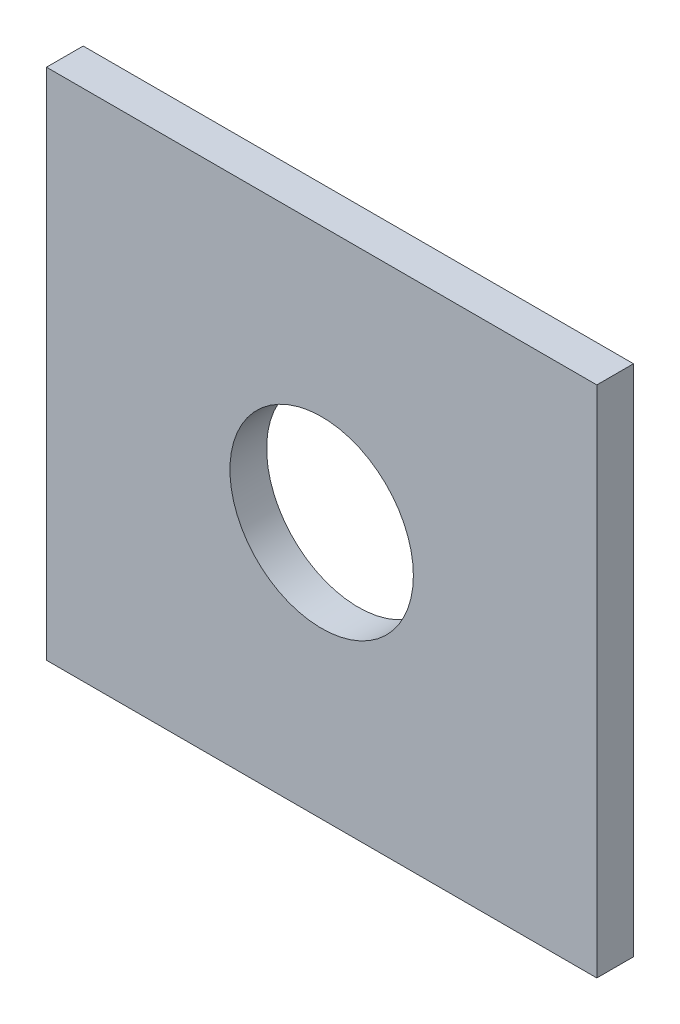
ISO-10303-21;
HEADER;
FILE_DESCRIPTION(('STEP AP214'),'2;1');
FILE_NAME('part.step','',(''),(''),'','','');
FILE_SCHEMA(('AUTOMOTIVE_DESIGN { 1 0 10303 214 1 1 1 1 }'));
ENDSEC;
DATA;
#1=APPLICATION_CONTEXT('core data for automotive mechanical design processes');
#2=APPLICATION_PROTOCOL_DEFINITION('international standard','automotive_design',2000,#1);
#3=PRODUCT_CONTEXT('',#1,'mechanical');
#4=PRODUCT('Part','Part','',(#3));
#5=PRODUCT_RELATED_PRODUCT_CATEGORY('part','',(#4));
#6=PRODUCT_DEFINITION_FORMATION('','',#4);
#7=PRODUCT_DEFINITION_CONTEXT('part definition',#1,'design');
#8=PRODUCT_DEFINITION('design','',#6,#7);
#9=PRODUCT_DEFINITION_SHAPE('','',#8);
#10=(LENGTH_UNIT() NAMED_UNIT(*) SI_UNIT(.MILLI.,.METRE.));
#11=(NAMED_UNIT(*) PLANE_ANGLE_UNIT() SI_UNIT($,.RADIAN.));
#12=(NAMED_UNIT(*) SI_UNIT($,.STERADIAN.) SOLID_ANGLE_UNIT());
#13=UNCERTAINTY_MEASURE_WITH_UNIT(LENGTH_MEASURE(1.E-05),#10,'distance_accuracy_value','');
#14=(GEOMETRIC_REPRESENTATION_CONTEXT(3) GLOBAL_UNCERTAINTY_ASSIGNED_CONTEXT((#13)) GLOBAL_UNIT_ASSIGNED_CONTEXT((#10,
#11,#12)) REPRESENTATION_CONTEXT('',''));
#15=CARTESIAN_POINT('',(0.,0.,0.));
#16=DIRECTION('',(0.,0.,1.));
#17=DIRECTION('',(1.,0.,0.));
#18=AXIS2_PLACEMENT_3D('',#15,#16,#17);
#19=CARTESIAN_POINT('',(0.,0.,10.));
#20=DIRECTION('',(0.,0.,1.));
#21=DIRECTION('',(1.,0.,0.));
#22=AXIS2_PLACEMENT_3D('',#19,#20,#21);
#23=PLANE('',#22);
#24=DIRECTION('',(0.,-1.,0.));
#25=VECTOR('',#24,1.);
#26=CARTESIAN_POINT('',(-75.,-70.,10.));
#27=LINE('',#26,#25);
#28=CARTESIAN_POINT('',(-75.,70.,10.));
#29=VERTEX_POINT('',#28);
#30=CARTESIAN_POINT('',(-75.,-70.,10.));
#31=VERTEX_POINT('',#30);
#32=EDGE_CURVE('E91',#29,#31,#27,.T.);
#33=ORIENTED_EDGE('',*,*,#32,.T.);
#34=DIRECTION('',(1.,0.,0.));
#35=VECTOR('',#34,1.);
#36=CARTESIAN_POINT('',(75.,-70.,10.));
#37=LINE('',#36,#35);
#38=CARTESIAN_POINT('',(75.,-70.,10.));
#39=VERTEX_POINT('',#38);
#40=EDGE_CURVE('E86',#31,#39,#37,.T.);
#41=ORIENTED_EDGE('',*,*,#40,.T.);
#42=DIRECTION('',(0.,1.,0.));
#43=VECTOR('',#42,1.);
#44=CARTESIAN_POINT('',(75.,-70.,10.));
#45=LINE('',#44,#43);
#46=CARTESIAN_POINT('',(75.,70.,10.));
#47=VERTEX_POINT('',#46);
#48=EDGE_CURVE('E89',#39,#47,#45,.T.);
#49=ORIENTED_EDGE('',*,*,#48,.T.);
#50=DIRECTION('',(-1.,0.,0.));
#51=VECTOR('',#50,1.);
#52=CARTESIAN_POINT('',(75.,70.,10.));
#53=LINE('',#52,#51);
#54=EDGE_CURVE('E56',#47,#29,#53,.T.);
#55=ORIENTED_EDGE('',*,*,#54,.T.);
#56=EDGE_LOOP('',(#33,#41,#49,#55));
#57=FACE_BOUND('',#56,.T.);
#58=CARTESIAN_POINT('',(0.,0.,10.));
#59=DIRECTION('',(0.,0.,1.));
#60=DIRECTION('',(1.,0.,0.));
#61=AXIS2_PLACEMENT_3D('',#58,#59,#60);
#62=CIRCLE('',#61,25.);
#63=CARTESIAN_POINT('',(25.,0.,10.));
#64=VERTEX_POINT('',#63);
#65=EDGE_CURVE('E112',#64,#64,#62,.T.);
#66=ORIENTED_EDGE('',*,*,#65,.F.);
#67=EDGE_LOOP('',(#66));
#68=FACE_BOUND('',#67,.T.);
#69=ADVANCED_FACE('F38',(#57,#68),#23,.T.);
#70=CARTESIAN_POINT('',(0.,0.,0.));
#71=DIRECTION('',(0.,0.,1.));
#72=DIRECTION('',(1.,0.,0.));
#73=AXIS2_PLACEMENT_3D('',#70,#71,#72);
#74=PLANE('',#73);
#75=DIRECTION('',(0.,-1.,0.));
#76=VECTOR('',#75,1.);
#77=CARTESIAN_POINT('',(-75.,-70.,0.));
#78=LINE('',#77,#76);
#79=CARTESIAN_POINT('',(-75.,70.,0.));
#80=VERTEX_POINT('',#79);
#81=CARTESIAN_POINT('',(-75.,-70.,0.));
#82=VERTEX_POINT('',#81);
#83=EDGE_CURVE('E108',#80,#82,#78,.T.);
#84=ORIENTED_EDGE('',*,*,#83,.F.);
#85=DIRECTION('',(-1.,0.,0.));
#86=VECTOR('',#85,1.);
#87=CARTESIAN_POINT('',(75.,70.,0.));
#88=LINE('',#87,#86);
#89=CARTESIAN_POINT('',(75.,70.,0.));
#90=VERTEX_POINT('',#89);
#91=EDGE_CURVE('E79',#90,#80,#88,.T.);
#92=ORIENTED_EDGE('',*,*,#91,.F.);
#93=DIRECTION('',(0.,1.,0.));
#94=VECTOR('',#93,1.);
#95=CARTESIAN_POINT('',(75.,-70.,0.));
#96=LINE('',#95,#94);
#97=CARTESIAN_POINT('',(75.,-70.,0.));
#98=VERTEX_POINT('',#97);
#99=EDGE_CURVE('E73',#98,#90,#96,.T.);
#100=ORIENTED_EDGE('',*,*,#99,.F.);
#101=DIRECTION('',(1.,0.,0.));
#102=VECTOR('',#101,1.);
#103=CARTESIAN_POINT('',(75.,-70.,0.));
#104=LINE('',#103,#102);
#105=EDGE_CURVE('E96',#82,#98,#104,.T.);
#106=ORIENTED_EDGE('',*,*,#105,.F.);
#107=EDGE_LOOP('',(#84,#92,#100,#106));
#108=FACE_BOUND('',#107,.T.);
#109=CARTESIAN_POINT('',(0.,0.,0.));
#110=DIRECTION('',(0.,0.,1.));
#111=DIRECTION('',(1.,0.,0.));
#112=AXIS2_PLACEMENT_3D('',#109,#110,#111);
#113=CIRCLE('',#112,25.);
#114=CARTESIAN_POINT('',(25.,0.,0.));
#115=VERTEX_POINT('',#114);
#116=EDGE_CURVE('E132',#115,#115,#113,.T.);
#117=ORIENTED_EDGE('',*,*,#116,.T.);
#118=EDGE_LOOP('',(#117));
#119=FACE_BOUND('',#118,.T.);
#120=ADVANCED_FACE('F126',(#108,#119),#74,.F.);
#121=CARTESIAN_POINT('',(-75.,-70.,10.));
#122=DIRECTION('',(1.,0.,0.));
#123=DIRECTION('',(0.,0.,-1.));
#124=AXIS2_PLACEMENT_3D('',#121,#122,#123);
#125=PLANE('',#124);
#126=ORIENTED_EDGE('',*,*,#83,.T.);
#127=DIRECTION('',(0.,0.,-1.));
#128=VECTOR('',#127,1.);
#129=CARTESIAN_POINT('',(-75.,-70.,10.));
#130=LINE('',#129,#128);
#131=EDGE_CURVE('E11',#31,#82,#130,.T.);
#132=ORIENTED_EDGE('',*,*,#131,.F.);
#133=ORIENTED_EDGE('',*,*,#32,.F.);
#134=DIRECTION('',(0.,0.,-1.));
#135=VECTOR('',#134,1.);
#136=CARTESIAN_POINT('',(-75.,70.,10.));
#137=LINE('',#136,#135);
#138=EDGE_CURVE('E104',#29,#80,#137,.T.);
#139=ORIENTED_EDGE('',*,*,#138,.T.);
#140=EDGE_LOOP('',(#126,#132,#133,#139));
#141=FACE_BOUND('',#140,.T.);
#142=ADVANCED_FACE('F40',(#141),#125,.F.);
#143=CARTESIAN_POINT('',(75.,-70.,10.));
#144=DIRECTION('',(0.,1.,0.));
#145=DIRECTION('',(-1.,0.,0.));
#146=AXIS2_PLACEMENT_3D('',#143,#144,#145);
#147=PLANE('',#146);
#148=ORIENTED_EDGE('',*,*,#105,.T.);
#149=DIRECTION('',(0.,0.,-1.));
#150=VECTOR('',#149,1.);
#151=CARTESIAN_POINT('',(75.,-70.,10.));
#152=LINE('',#151,#150);
#153=EDGE_CURVE('E48',#39,#98,#152,.T.);
#154=ORIENTED_EDGE('',*,*,#153,.F.);
#155=ORIENTED_EDGE('',*,*,#40,.F.);
#156=ORIENTED_EDGE('',*,*,#131,.T.);
#157=EDGE_LOOP('',(#148,#154,#155,#156));
#158=FACE_BOUND('',#157,.T.);
#159=ADVANCED_FACE('F95',(#158),#147,.F.);
#160=CARTESIAN_POINT('',(75.,-70.,10.));
#161=DIRECTION('',(-1.,0.,0.));
#162=DIRECTION('',(0.,0.,1.));
#163=AXIS2_PLACEMENT_3D('',#160,#161,#162);
#164=PLANE('',#163);
#165=ORIENTED_EDGE('',*,*,#99,.T.);
#166=DIRECTION('',(0.,0.,-1.));
#167=VECTOR('',#166,1.);
#168=CARTESIAN_POINT('',(75.,70.,10.));
#169=LINE('',#168,#167);
#170=EDGE_CURVE('E98',#47,#90,#169,.T.);
#171=ORIENTED_EDGE('',*,*,#170,.F.);
#172=ORIENTED_EDGE('',*,*,#48,.F.);
#173=ORIENTED_EDGE('',*,*,#153,.T.);
#174=EDGE_LOOP('',(#165,#171,#172,#173));
#175=FACE_BOUND('',#174,.T.);
#176=ADVANCED_FACE('F99',(#175),#164,.F.);
#177=CARTESIAN_POINT('',(75.,70.,10.));
#178=DIRECTION('',(0.,-1.,0.));
#179=DIRECTION('',(1.,0.,0.));
#180=AXIS2_PLACEMENT_3D('',#177,#178,#179);
#181=PLANE('',#180);
#182=ORIENTED_EDGE('',*,*,#91,.T.);
#183=ORIENTED_EDGE('',*,*,#138,.F.);
#184=ORIENTED_EDGE('',*,*,#54,.F.);
#185=ORIENTED_EDGE('',*,*,#170,.T.);
#186=EDGE_LOOP('',(#182,#183,#184,#185));
#187=FACE_BOUND('',#186,.T.);
#188=ADVANCED_FACE('F123',(#187),#181,.F.);
#189=CARTESIAN_POINT('',(0.,0.,10.));
#190=DIRECTION('',(0.,0.,-1.));
#191=DIRECTION('',(-1.,0.,0.));
#192=AXIS2_PLACEMENT_3D('',#189,#190,#191);
#193=CYLINDRICAL_SURFACE('',#192,25.);
#194=ORIENTED_EDGE('',*,*,#65,.T.);
#195=EDGE_LOOP('',(#194));
#196=FACE_BOUND('',#195,.T.);
#197=ORIENTED_EDGE('',*,*,#116,.F.);
#198=EDGE_LOOP('',(#197));
#199=FACE_BOUND('',#198,.T.);
#200=ADVANCED_FACE('F141',(#196,#199),#193,.F.);
#201=CLOSED_SHELL('',(#69,#120,#142,#159,#176,#188,#200));
#202=MANIFOLD_SOLID_BREP('B2',#201);
#203=ADVANCED_BREP_SHAPE_REPRESENTATION('',(#18,#202),#14);
#204=SHAPE_DEFINITION_REPRESENTATION(#9,#203);
ENDSEC;
END-ISO-10303-21;
